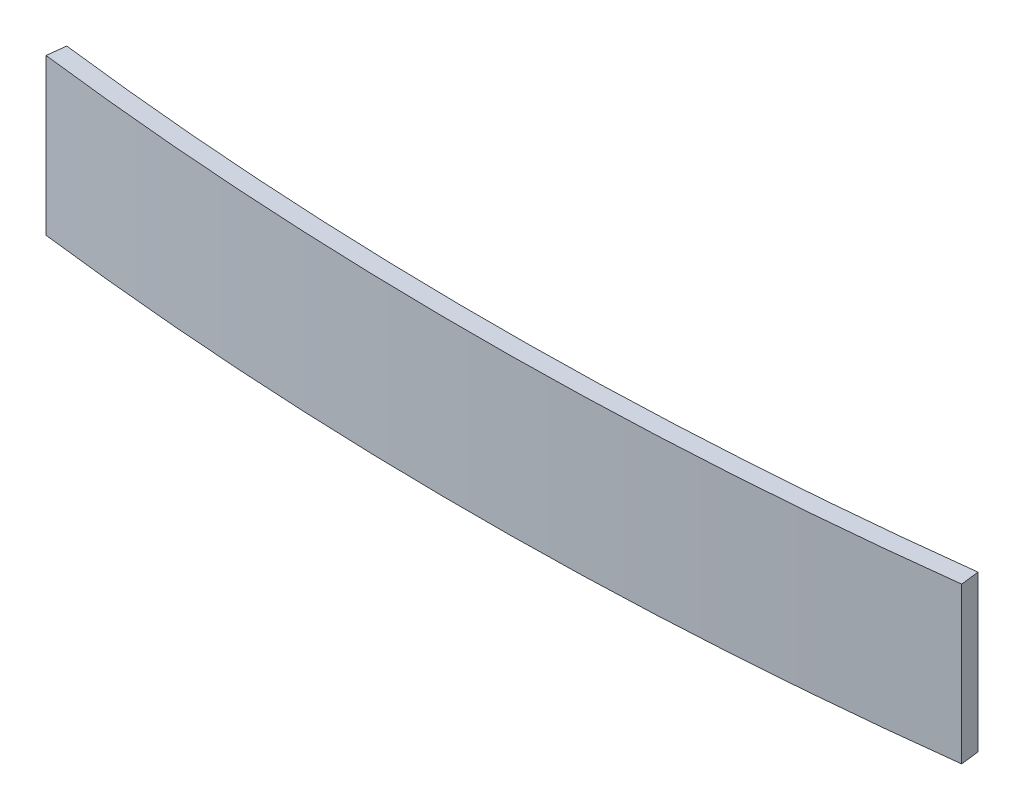
ISO-10303-21;
HEADER;
FILE_DESCRIPTION(('STEP AP214'),'2;1');
FILE_NAME('part.step','',(''),(''),'','','');
FILE_SCHEMA(('AUTOMOTIVE_DESIGN { 1 0 10303 214 1 1 1 1 }'));
ENDSEC;
DATA;
#1=APPLICATION_CONTEXT('core data for automotive mechanical design processes');
#2=APPLICATION_PROTOCOL_DEFINITION('international standard','automotive_design',2000,#1);
#3=PRODUCT_CONTEXT('',#1,'mechanical');
#4=PRODUCT('Part','Part','',(#3));
#5=PRODUCT_RELATED_PRODUCT_CATEGORY('part','',(#4));
#6=PRODUCT_DEFINITION_FORMATION('','',#4);
#7=PRODUCT_DEFINITION_CONTEXT('part definition',#1,'design');
#8=PRODUCT_DEFINITION('design','',#6,#7);
#9=PRODUCT_DEFINITION_SHAPE('','',#8);
#10=(LENGTH_UNIT() NAMED_UNIT(*) SI_UNIT(.MILLI.,.METRE.));
#11=(NAMED_UNIT(*) PLANE_ANGLE_UNIT() SI_UNIT($,.RADIAN.));
#12=(NAMED_UNIT(*) SI_UNIT($,.STERADIAN.) SOLID_ANGLE_UNIT());
#13=UNCERTAINTY_MEASURE_WITH_UNIT(LENGTH_MEASURE(1.E-05),#10,'distance_accuracy_value','');
#14=(GEOMETRIC_REPRESENTATION_CONTEXT(3) GLOBAL_UNCERTAINTY_ASSIGNED_CONTEXT((#13)) GLOBAL_UNIT_ASSIGNED_CONTEXT((#10,
#11,#12)) REPRESENTATION_CONTEXT('',''));
#15=CARTESIAN_POINT('',(0.,0.,0.));
#16=DIRECTION('',(0.,0.,1.));
#17=DIRECTION('',(1.,0.,0.));
#18=AXIS2_PLACEMENT_3D('',#15,#16,#17);
#19=CARTESIAN_POINT('',(0.384713370655349,25.,-604.979337781911));
#20=DIRECTION('',(0.,-1.,0.));
#21=DIRECTION('',(0.,0.,-1.));
#22=AXIS2_PLACEMENT_3D('',#19,#20,#21);
#23=CYLINDRICAL_SURFACE('',#22,606.817392300454);
#24=CARTESIAN_POINT('',(0.384713370655349,0.,-604.979337781911));
#25=DIRECTION('',(0.,1.,0.));
#26=DIRECTION('',(0.,0.,1.));
#27=AXIS2_PLACEMENT_3D('',#24,#25,#26);
#28=CIRCLE('',#27,606.817392300454);
#29=CARTESIAN_POINT('',(-73.1152866293447,0.,-2.62969048532372));
#30=VERTEX_POINT('',#29);
#31=CARTESIAN_POINT('',(73.8847133706553,0.,-2.62969048532372));
#32=VERTEX_POINT('',#31);
#33=EDGE_CURVE('E99',#30,#32,#28,.T.);
#34=ORIENTED_EDGE('',*,*,#33,.T.);
#35=DIRECTION('',(0.,-1.,0.));
#36=VECTOR('',#35,1.);
#37=CARTESIAN_POINT('',(73.8847133706553,25.,-2.62969048532372));
#38=LINE('',#37,#36);
#39=CARTESIAN_POINT('',(73.8847133706553,25.,-2.62969048532372));
#40=VERTEX_POINT('',#39);
#41=EDGE_CURVE('E11',#40,#32,#38,.T.);
#42=ORIENTED_EDGE('',*,*,#41,.F.);
#43=CARTESIAN_POINT('',(0.384713370655349,25.,-604.979337781911));
#44=DIRECTION('',(0.,1.,0.));
#45=DIRECTION('',(0.,0.,1.));
#46=AXIS2_PLACEMENT_3D('',#43,#44,#45);
#47=CIRCLE('',#46,606.817392300454);
#48=CARTESIAN_POINT('',(-73.1152866293447,25.,-2.62969048532372));
#49=VERTEX_POINT('',#48);
#50=EDGE_CURVE('E87',#49,#40,#47,.T.);
#51=ORIENTED_EDGE('',*,*,#50,.F.);
#52=DIRECTION('',(0.,-1.,0.));
#53=VECTOR('',#52,1.);
#54=CARTESIAN_POINT('',(-73.1152866293447,25.,-2.62969048532372));
#55=LINE('',#54,#53);
#56=EDGE_CURVE('E95',#49,#30,#55,.T.);
#57=ORIENTED_EDGE('',*,*,#56,.T.);
#58=EDGE_LOOP('',(#34,#42,#51,#57));
#59=FACE_BOUND('',#58,.T.);
#60=ADVANCED_FACE('F36',(#59),#23,.T.);
#61=CARTESIAN_POINT('',(73.8847133706553,25.,-2.62969048532372));
#62=DIRECTION('',(-0.992637414384351,0.,0.121123753097194));
#63=DIRECTION('',(0.121123753097194,0.,0.992637414384351));
#64=AXIS2_PLACEMENT_3D('',#61,#62,#63);
#65=PLANE('',#64);
#66=DIRECTION('',(-0.121123753097194,0.,-0.992637414384351));
#67=VECTOR('',#66,1.);
#68=CARTESIAN_POINT('',(73.8847133706553,0.,-2.62969048532372));
#69=LINE('',#68,#67);
#70=CARTESIAN_POINT('',(73.5213421113638,0.,-5.60760272847682));
#71=VERTEX_POINT('',#70);
#72=EDGE_CURVE('E91',#32,#71,#69,.T.);
#73=ORIENTED_EDGE('',*,*,#72,.T.);
#74=DIRECTION('',(0.,-1.,0.));
#75=VECTOR('',#74,1.);
#76=CARTESIAN_POINT('',(73.5213421113638,25.,-5.60760272847682));
#77=LINE('',#76,#75);
#78=CARTESIAN_POINT('',(73.5213421113638,25.,-5.60760272847682));
#79=VERTEX_POINT('',#78);
#80=EDGE_CURVE('E44',#79,#71,#77,.T.);
#81=ORIENTED_EDGE('',*,*,#80,.F.);
#82=DIRECTION('',(-0.121123753097194,0.,-0.992637414384351));
#83=VECTOR('',#82,1.);
#84=CARTESIAN_POINT('',(73.8847133706553,25.,-2.62969048532372));
#85=LINE('',#84,#83);
#86=EDGE_CURVE('E82',#40,#79,#85,.T.);
#87=ORIENTED_EDGE('',*,*,#86,.F.);
#88=ORIENTED_EDGE('',*,*,#41,.T.);
#89=EDGE_LOOP('',(#73,#81,#87,#88));
#90=FACE_BOUND('',#89,.T.);
#91=ADVANCED_FACE('F90',(#90),#65,.F.);
#92=CARTESIAN_POINT('',(0.384713370655349,25.,-604.979337781911));
#93=DIRECTION('',(0.,-1.,0.));
#94=DIRECTION('',(0.,0.,-1.));
#95=AXIS2_PLACEMENT_3D('',#92,#93,#94);
#96=CYLINDRICAL_SURFACE('',#95,603.817392300454);
#97=CARTESIAN_POINT('',(0.384713370655349,0.,-604.979337781911));
#98=DIRECTION('',(0.,-1.,0.));
#99=DIRECTION('',(0.,0.,1.));
#100=AXIS2_PLACEMENT_3D('',#97,#98,#99);
#101=CIRCLE('',#100,603.817392300454);
#102=CARTESIAN_POINT('',(-72.7519153700538,0.,-5.60760272847682));
#103=VERTEX_POINT('',#102);
#104=EDGE_CURVE('E69',#71,#103,#101,.T.);
#105=ORIENTED_EDGE('',*,*,#104,.T.);
#106=DIRECTION('',(0.,-1.,0.));
#107=VECTOR('',#106,1.);
#108=CARTESIAN_POINT('',(-72.7519153700538,25.,-5.60760272847682));
#109=LINE('',#108,#107);
#110=CARTESIAN_POINT('',(-72.7519153700538,25.,-5.60760272847682));
#111=VERTEX_POINT('',#110);
#112=EDGE_CURVE('E92',#111,#103,#109,.T.);
#113=ORIENTED_EDGE('',*,*,#112,.F.);
#114=CARTESIAN_POINT('',(0.384713370655349,25.,-604.979337781911));
#115=DIRECTION('',(0.,-1.,0.));
#116=DIRECTION('',(0.,0.,1.));
#117=AXIS2_PLACEMENT_3D('',#114,#115,#116);
#118=CIRCLE('',#117,603.817392300454);
#119=EDGE_CURVE('E85',#79,#111,#118,.T.);
#120=ORIENTED_EDGE('',*,*,#119,.F.);
#121=ORIENTED_EDGE('',*,*,#80,.T.);
#122=EDGE_LOOP('',(#105,#113,#120,#121));
#123=FACE_BOUND('',#122,.T.);
#124=ADVANCED_FACE('F93',(#123),#96,.F.);
#125=CARTESIAN_POINT('',(-73.1152866293447,25.,-2.62969048532372));
#126=DIRECTION('',(0.992637414384379,0.,0.121123753096967));
#127=DIRECTION('',(0.121123753096967,0.,-0.992637414384379));
#128=AXIS2_PLACEMENT_3D('',#125,#126,#127);
#129=PLANE('',#128);
#130=DIRECTION('',(-0.121123753096967,0.,0.992637414384379));
#131=VECTOR('',#130,1.);
#132=CARTESIAN_POINT('',(-73.1152866293447,0.,-2.62969048532372));
#133=LINE('',#132,#131);
#134=EDGE_CURVE('E75',#103,#30,#133,.T.);
#135=ORIENTED_EDGE('',*,*,#134,.T.);
#136=ORIENTED_EDGE('',*,*,#56,.F.);
#137=DIRECTION('',(-0.121123753096967,0.,0.992637414384379));
#138=VECTOR('',#137,1.);
#139=CARTESIAN_POINT('',(-73.1152866293447,25.,-2.62969048532372));
#140=LINE('',#139,#138);
#141=EDGE_CURVE('E52',#111,#49,#140,.T.);
#142=ORIENTED_EDGE('',*,*,#141,.F.);
#143=ORIENTED_EDGE('',*,*,#112,.T.);
#144=EDGE_LOOP('',(#135,#136,#142,#143));
#145=FACE_BOUND('',#144,.T.);
#146=ADVANCED_FACE('F106',(#145),#129,.F.);
#147=CARTESIAN_POINT('',(0.384713370655349,25.,-604.979337781911));
#148=DIRECTION('',(0.,1.,0.));
#149=DIRECTION('',(0.,0.,1.));
#150=AXIS2_PLACEMENT_3D('',#147,#148,#149);
#151=PLANE('',#150);
#152=ORIENTED_EDGE('',*,*,#50,.T.);
#153=ORIENTED_EDGE('',*,*,#86,.T.);
#154=ORIENTED_EDGE('',*,*,#119,.T.);
#155=ORIENTED_EDGE('',*,*,#141,.T.);
#156=EDGE_LOOP('',(#152,#153,#154,#155));
#157=FACE_BOUND('',#156,.T.);
#158=ADVANCED_FACE('F83',(#157),#151,.T.);
#159=CARTESIAN_POINT('',(0.384713370655349,0.,-604.979337781911));
#160=DIRECTION('',(0.,1.,0.));
#161=DIRECTION('',(0.,0.,1.));
#162=AXIS2_PLACEMENT_3D('',#159,#160,#161);
#163=PLANE('',#162);
#164=ORIENTED_EDGE('',*,*,#33,.F.);
#165=ORIENTED_EDGE('',*,*,#134,.F.);
#166=ORIENTED_EDGE('',*,*,#104,.F.);
#167=ORIENTED_EDGE('',*,*,#72,.F.);
#168=EDGE_LOOP('',(#164,#165,#166,#167));
#169=FACE_BOUND('',#168,.T.);
#170=ADVANCED_FACE('F109',(#169),#163,.F.);
#171=CLOSED_SHELL('',(#60,#91,#124,#146,#158,#170));
#172=MANIFOLD_SOLID_BREP('B2',#171);
#173=ADVANCED_BREP_SHAPE_REPRESENTATION('',(#18,#172),#14);
#174=SHAPE_DEFINITION_REPRESENTATION(#9,#173);
ENDSEC;
END-ISO-10303-21;
